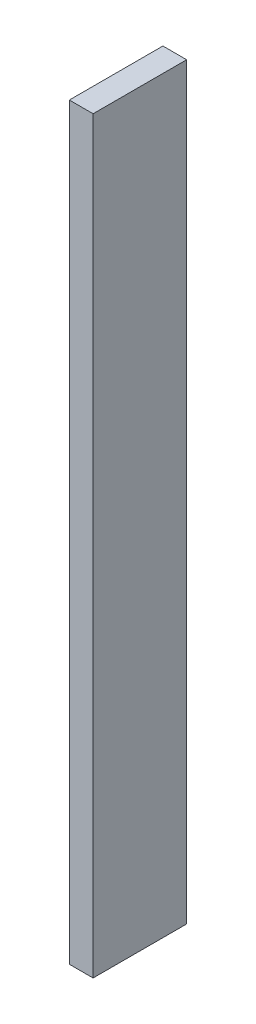
ISO-10303-21;
HEADER;
FILE_DESCRIPTION(('STEP AP214'),'2;1');
FILE_NAME('part.step','',(''),(''),'','','');
FILE_SCHEMA(('AUTOMOTIVE_DESIGN { 1 0 10303 214 1 1 1 1 }'));
ENDSEC;
DATA;
#1=APPLICATION_CONTEXT('core data for automotive mechanical design processes');
#2=APPLICATION_PROTOCOL_DEFINITION('international standard','automotive_design',2000,#1);
#3=PRODUCT_CONTEXT('',#1,'mechanical');
#4=PRODUCT('Part','Part','',(#3));
#5=PRODUCT_RELATED_PRODUCT_CATEGORY('part','',(#4));
#6=PRODUCT_DEFINITION_FORMATION('','',#4);
#7=PRODUCT_DEFINITION_CONTEXT('part definition',#1,'design');
#8=PRODUCT_DEFINITION('design','',#6,#7);
#9=PRODUCT_DEFINITION_SHAPE('','',#8);
#10=(LENGTH_UNIT() NAMED_UNIT(*) SI_UNIT(.MILLI.,.METRE.));
#11=(NAMED_UNIT(*) PLANE_ANGLE_UNIT() SI_UNIT($,.RADIAN.));
#12=(NAMED_UNIT(*) SI_UNIT($,.STERADIAN.) SOLID_ANGLE_UNIT());
#13=UNCERTAINTY_MEASURE_WITH_UNIT(LENGTH_MEASURE(1.E-05),#10,'distance_accuracy_value','');
#14=(GEOMETRIC_REPRESENTATION_CONTEXT(3) GLOBAL_UNCERTAINTY_ASSIGNED_CONTEXT((#13)) GLOBAL_UNIT_ASSIGNED_CONTEXT((#10,
#11,#12)) REPRESENTATION_CONTEXT('',''));
#15=CARTESIAN_POINT('',(0.,0.,0.));
#16=DIRECTION('',(0.,0.,1.));
#17=DIRECTION('',(1.,0.,0.));
#18=AXIS2_PLACEMENT_3D('',#15,#16,#17);
#19=CARTESIAN_POINT('',(12.7,200.,-25.));
#20=DIRECTION('',(0.,0.,1.));
#21=DIRECTION('',(0.,-1.,0.));
#22=AXIS2_PLACEMENT_3D('',#19,#20,#21);
#23=PLANE('',#22);
#24=DIRECTION('',(0.,1.,0.));
#25=VECTOR('',#24,1.);
#26=CARTESIAN_POINT('',(0.,200.,-25.));
#27=LINE('',#26,#25);
#28=CARTESIAN_POINT('',(0.,-200.,-25.));
#29=VERTEX_POINT('',#28);
#30=CARTESIAN_POINT('',(0.,200.,-25.));
#31=VERTEX_POINT('',#30);
#32=EDGE_CURVE('E100',#29,#31,#27,.T.);
#33=ORIENTED_EDGE('',*,*,#32,.T.);
#34=DIRECTION('',(-1.,0.,0.));
#35=VECTOR('',#34,1.);
#36=CARTESIAN_POINT('',(12.7,200.,-25.));
#37=LINE('',#36,#35);
#38=CARTESIAN_POINT('',(12.7,200.,-25.));
#39=VERTEX_POINT('',#38);
#40=EDGE_CURVE('E11',#39,#31,#37,.T.);
#41=ORIENTED_EDGE('',*,*,#40,.F.);
#42=DIRECTION('',(0.,1.,0.));
#43=VECTOR('',#42,1.);
#44=CARTESIAN_POINT('',(12.7,200.,-25.));
#45=LINE('',#44,#43);
#46=CARTESIAN_POINT('',(12.7,-200.,-25.));
#47=VERTEX_POINT('',#46);
#48=EDGE_CURVE('E88',#47,#39,#45,.T.);
#49=ORIENTED_EDGE('',*,*,#48,.F.);
#50=DIRECTION('',(-1.,0.,0.));
#51=VECTOR('',#50,1.);
#52=CARTESIAN_POINT('',(12.7,-200.,-25.));
#53=LINE('',#52,#51);
#54=EDGE_CURVE('E96',#47,#29,#53,.T.);
#55=ORIENTED_EDGE('',*,*,#54,.T.);
#56=EDGE_LOOP('',(#33,#41,#49,#55));
#57=FACE_BOUND('',#56,.T.);
#58=ADVANCED_FACE('F37',(#57),#23,.F.);
#59=CARTESIAN_POINT('',(12.7,200.,25.));
#60=DIRECTION('',(0.,-1.,0.));
#61=DIRECTION('',(0.,0.,-1.));
#62=AXIS2_PLACEMENT_3D('',#59,#60,#61);
#63=PLANE('',#62);
#64=DIRECTION('',(0.,0.,1.));
#65=VECTOR('',#64,1.);
#66=CARTESIAN_POINT('',(0.,200.,25.));
#67=LINE('',#66,#65);
#68=CARTESIAN_POINT('',(0.,200.,25.));
#69=VERTEX_POINT('',#68);
#70=EDGE_CURVE('E92',#31,#69,#67,.T.);
#71=ORIENTED_EDGE('',*,*,#70,.T.);
#72=DIRECTION('',(-1.,0.,0.));
#73=VECTOR('',#72,1.);
#74=CARTESIAN_POINT('',(12.7,200.,25.));
#75=LINE('',#74,#73);
#76=CARTESIAN_POINT('',(12.7,200.,25.));
#77=VERTEX_POINT('',#76);
#78=EDGE_CURVE('E45',#77,#69,#75,.T.);
#79=ORIENTED_EDGE('',*,*,#78,.F.);
#80=DIRECTION('',(0.,0.,1.));
#81=VECTOR('',#80,1.);
#82=CARTESIAN_POINT('',(12.7,200.,25.));
#83=LINE('',#82,#81);
#84=EDGE_CURVE('E83',#39,#77,#83,.T.);
#85=ORIENTED_EDGE('',*,*,#84,.F.);
#86=ORIENTED_EDGE('',*,*,#40,.T.);
#87=EDGE_LOOP('',(#71,#79,#85,#86));
#88=FACE_BOUND('',#87,.T.);
#89=ADVANCED_FACE('F91',(#88),#63,.F.);
#90=CARTESIAN_POINT('',(12.7,200.,25.));
#91=DIRECTION('',(0.,0.,-1.));
#92=DIRECTION('',(0.,1.,0.));
#93=AXIS2_PLACEMENT_3D('',#90,#91,#92);
#94=PLANE('',#93);
#95=DIRECTION('',(0.,-1.,0.));
#96=VECTOR('',#95,1.);
#97=CARTESIAN_POINT('',(0.,200.,25.));
#98=LINE('',#97,#96);
#99=CARTESIAN_POINT('',(0.,-200.,25.));
#100=VERTEX_POINT('',#99);
#101=EDGE_CURVE('E70',#69,#100,#98,.T.);
#102=ORIENTED_EDGE('',*,*,#101,.T.);
#103=DIRECTION('',(-1.,0.,0.));
#104=VECTOR('',#103,1.);
#105=CARTESIAN_POINT('',(12.7,-200.,25.));
#106=LINE('',#105,#104);
#107=CARTESIAN_POINT('',(12.7,-200.,25.));
#108=VERTEX_POINT('',#107);
#109=EDGE_CURVE('E93',#108,#100,#106,.T.);
#110=ORIENTED_EDGE('',*,*,#109,.F.);
#111=DIRECTION('',(0.,-1.,0.));
#112=VECTOR('',#111,1.);
#113=CARTESIAN_POINT('',(12.7,200.,25.));
#114=LINE('',#113,#112);
#115=EDGE_CURVE('E86',#77,#108,#114,.T.);
#116=ORIENTED_EDGE('',*,*,#115,.F.);
#117=ORIENTED_EDGE('',*,*,#78,.T.);
#118=EDGE_LOOP('',(#102,#110,#116,#117));
#119=FACE_BOUND('',#118,.T.);
#120=ADVANCED_FACE('F94',(#119),#94,.F.);
#121=CARTESIAN_POINT('',(12.7,-200.,25.));
#122=DIRECTION('',(0.,1.,0.));
#123=DIRECTION('',(0.,0.,1.));
#124=AXIS2_PLACEMENT_3D('',#121,#122,#123);
#125=PLANE('',#124);
#126=DIRECTION('',(0.,0.,-1.));
#127=VECTOR('',#126,1.);
#128=CARTESIAN_POINT('',(0.,-200.,25.));
#129=LINE('',#128,#127);
#130=EDGE_CURVE('E76',#100,#29,#129,.T.);
#131=ORIENTED_EDGE('',*,*,#130,.T.);
#132=ORIENTED_EDGE('',*,*,#54,.F.);
#133=DIRECTION('',(0.,0.,-1.));
#134=VECTOR('',#133,1.);
#135=CARTESIAN_POINT('',(12.7,-200.,25.));
#136=LINE('',#135,#134);
#137=EDGE_CURVE('E53',#108,#47,#136,.T.);
#138=ORIENTED_EDGE('',*,*,#137,.F.);
#139=ORIENTED_EDGE('',*,*,#109,.T.);
#140=EDGE_LOOP('',(#131,#132,#138,#139));
#141=FACE_BOUND('',#140,.T.);
#142=ADVANCED_FACE('F107',(#141),#125,.F.);
#143=CARTESIAN_POINT('',(12.7,0.,0.));
#144=DIRECTION('',(1.,0.,0.));
#145=DIRECTION('',(0.,0.,-1.));
#146=AXIS2_PLACEMENT_3D('',#143,#144,#145);
#147=PLANE('',#146);
#148=ORIENTED_EDGE('',*,*,#48,.T.);
#149=ORIENTED_EDGE('',*,*,#84,.T.);
#150=ORIENTED_EDGE('',*,*,#115,.T.);
#151=ORIENTED_EDGE('',*,*,#137,.T.);
#152=EDGE_LOOP('',(#148,#149,#150,#151));
#153=FACE_BOUND('',#152,.T.);
#154=ADVANCED_FACE('F84',(#153),#147,.T.);
#155=CARTESIAN_POINT('',(0.,0.,0.));
#156=DIRECTION('',(1.,0.,0.));
#157=DIRECTION('',(0.,0.,-1.));
#158=AXIS2_PLACEMENT_3D('',#155,#156,#157);
#159=PLANE('',#158);
#160=ORIENTED_EDGE('',*,*,#32,.F.);
#161=ORIENTED_EDGE('',*,*,#130,.F.);
#162=ORIENTED_EDGE('',*,*,#101,.F.);
#163=ORIENTED_EDGE('',*,*,#70,.F.);
#164=EDGE_LOOP('',(#160,#161,#162,#163));
#165=FACE_BOUND('',#164,.T.);
#166=ADVANCED_FACE('F110',(#165),#159,.F.);
#167=CLOSED_SHELL('',(#58,#89,#120,#142,#154,#166));
#168=MANIFOLD_SOLID_BREP('B2',#167);
#169=ADVANCED_BREP_SHAPE_REPRESENTATION('',(#18,#168),#14);
#170=SHAPE_DEFINITION_REPRESENTATION(#9,#169);
ENDSEC;
END-ISO-10303-21;
